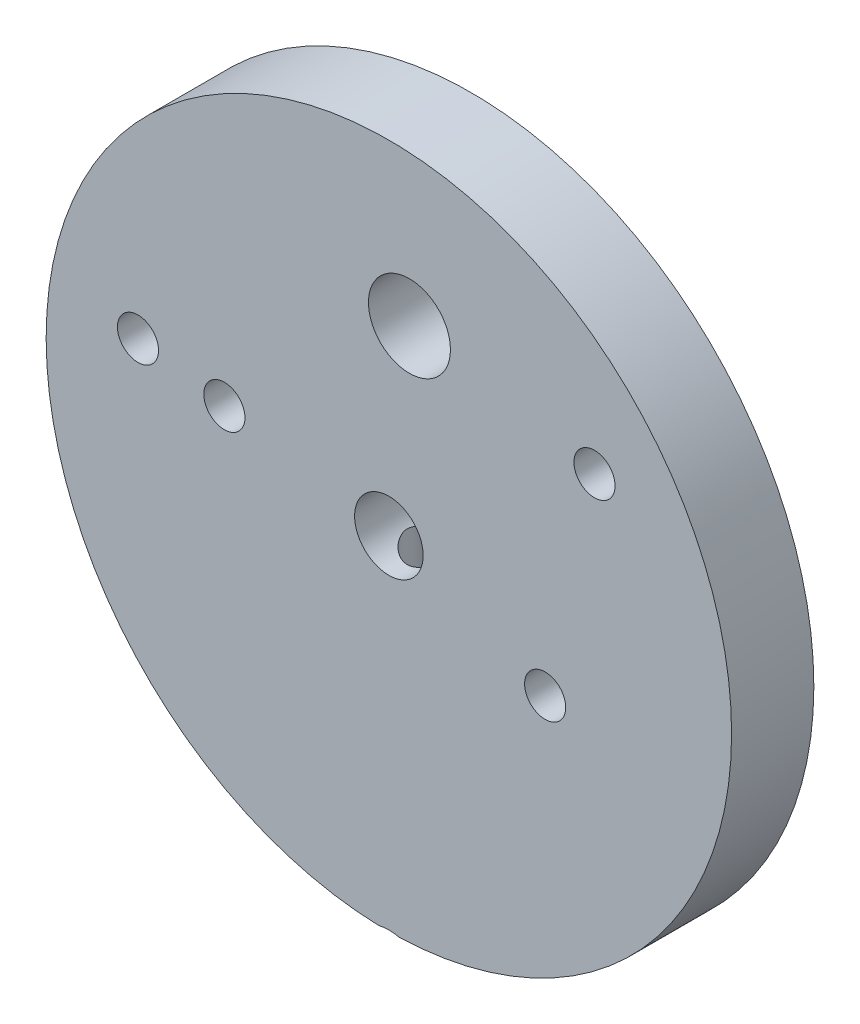
ISO-10303-21;
HEADER;
FILE_DESCRIPTION(('STEP AP214'),'2;1');
FILE_NAME('part.step','',(''),(''),'','','');
FILE_SCHEMA(('AUTOMOTIVE_DESIGN { 1 0 10303 214 1 1 1 1 }'));
ENDSEC;
DATA;
#1=APPLICATION_CONTEXT('core data for automotive mechanical design processes');
#2=APPLICATION_PROTOCOL_DEFINITION('international standard','automotive_design',2000,#1);
#3=PRODUCT_CONTEXT('',#1,'mechanical');
#4=PRODUCT('Part','Part','',(#3));
#5=PRODUCT_RELATED_PRODUCT_CATEGORY('part','',(#4));
#6=PRODUCT_DEFINITION_FORMATION('','',#4);
#7=PRODUCT_DEFINITION_CONTEXT('part definition',#1,'design');
#8=PRODUCT_DEFINITION('design','',#6,#7);
#9=PRODUCT_DEFINITION_SHAPE('','',#8);
#10=(LENGTH_UNIT() NAMED_UNIT(*) SI_UNIT(.MILLI.,.METRE.));
#11=(NAMED_UNIT(*) PLANE_ANGLE_UNIT() SI_UNIT($,.RADIAN.));
#12=(NAMED_UNIT(*) SI_UNIT($,.STERADIAN.) SOLID_ANGLE_UNIT());
#13=UNCERTAINTY_MEASURE_WITH_UNIT(LENGTH_MEASURE(1.E-05),#10,'distance_accuracy_value','');
#14=(GEOMETRIC_REPRESENTATION_CONTEXT(3) GLOBAL_UNCERTAINTY_ASSIGNED_CONTEXT((#13)) GLOBAL_UNIT_ASSIGNED_CONTEXT((#10,
#11,#12)) REPRESENTATION_CONTEXT('',''));
#15=CARTESIAN_POINT('',(0.,0.,0.));
#16=DIRECTION('',(0.,0.,1.));
#17=DIRECTION('',(1.,0.,0.));
#18=AXIS2_PLACEMENT_3D('',#15,#16,#17);
#19=CARTESIAN_POINT('',(0.,0.,3.));
#20=DIRECTION('',(0.,0.,1.));
#21=DIRECTION('',(1.,0.,0.));
#22=AXIS2_PLACEMENT_3D('',#19,#20,#21);
#23=PLANE('',#22);
#24=CARTESIAN_POINT('',(-2.83664534621359,-26.0287476091661,3.));
#25=CARTESIAN_POINT('',(-2.76531072517493,-25.979747647708,3.));
#26=CARTESIAN_POINT('',(-2.6935251877055,-25.9313937572425,3.));
#27=CARTESIAN_POINT('',(-2.54890587795035,-25.8362334592615,3.));
#28=CARTESIAN_POINT('',(-2.47607179603977,-25.7894275228763,3.));
#29=CARTESIAN_POINT('',(-2.32872818174244,-25.6973209891236,3.));
#30=CARTESIAN_POINT('',(-2.25421040362229,-25.6520335125885,3.));
#31=CARTESIAN_POINT('',(-2.10387584627041,-25.5636873397159,3.));
#32=CARTESIAN_POINT('',(-2.02805917154243,-25.5206284651849,3.));
#33=CARTESIAN_POINT('',(-1.79346473550118,-25.3926890623925,3.));
#34=CARTESIAN_POINT('',(-1.63229987426929,-25.312089953461,3.));
#35=CARTESIAN_POINT('',(-1.30302104487734,-25.1674390749372,3.));
#36=CARTESIAN_POINT('',(-1.13493074142441,-25.1033356270002,3.));
#37=CARTESIAN_POINT('',(-0.888434419115741,-25.0279764703033,3.));
#38=CARTESIAN_POINT('',(-0.8128906352692,-25.0073008818853,3.));
#39=CARTESIAN_POINT('',(-0.660576482159613,-24.9709760094303,3.));
#40=CARTESIAN_POINT('',(-0.583805949312308,-24.9553274017014,3.));
#41=CARTESIAN_POINT('',(-0.430179544278816,-24.929749902811,3.));
#42=CARTESIAN_POINT('',(-0.353333964597223,-24.9197597930517,3.));
#43=CARTESIAN_POINT('',(-0.199107895655327,-24.9056191999211,3.));
#44=CARTESIAN_POINT('',(-0.121727433519484,-24.9014684225826,3.));
#45=CARTESIAN_POINT('',(0.0484399656678558,-24.8989599826423,3.));
#46=CARTESIAN_POINT('',(0.141249236879402,-24.9019094067401,3.));
#47=CARTESIAN_POINT('',(0.326212401348018,-24.9162730746567,3.));
#48=CARTESIAN_POINT('',(0.418366158053664,-24.9276890328668,3.));
#49=CARTESIAN_POINT('',(0.602608166973431,-24.9585566782451,3.));
#50=CARTESIAN_POINT('',(0.694678002494478,-24.9781169747769,3.));
#51=CARTESIAN_POINT('',(0.876977203352027,-25.0243099762964,3.));
#52=CARTESIAN_POINT('',(0.967206813915699,-25.050941732227,3.));
#53=CARTESIAN_POINT('',(1.24673620285726,-25.1437740909094,3.));
#54=CARTESIAN_POINT('',(1.43252000344217,-25.2206319752431,3.));
#55=CARTESIAN_POINT('',(1.7047064715636,-25.3495840799246,3.));
#56=CARTESIAN_POINT('',(1.79451611571029,-25.3949436771718,3.));
#57=CARTESIAN_POINT('',(1.97215660266382,-25.4893928032348,3.));
#58=CARTESIAN_POINT('',(2.05998776589235,-25.5384817223611,3.));
#59=CARTESIAN_POINT('',(2.23039384174165,-25.6376531878738,3.));
#60=CARTESIAN_POINT('',(2.31303842428243,-25.6876173073952,3.));
#61=CARTESIAN_POINT('',(2.47689739966926,-25.7898487587656,3.));
#62=CARTESIAN_POINT('',(2.55811168003427,-25.8421162706346,3.));
#63=CARTESIAN_POINT('',(2.71865064586211,-25.9481415803404,3.));
#64=CARTESIAN_POINT('',(2.79798511486534,-26.0018846264753,3.));
#65=CARTESIAN_POINT('',(2.95553686167846,-26.1109377048038,3.));
#66=CARTESIAN_POINT('',(3.03375445763521,-26.166247276808,3.));
#67=CARTESIAN_POINT('',(3.11149968366827,-26.2222020176604,3.));
#68=B_SPLINE_CURVE_WITH_KNOTS('',3,(#24,#25,#26,#27,#28,#29,#30,#31,#32,#33,#34,#35,#36,#37,#38,
#39,#40,#41,#42,#43,#44,#45,#46,#47,#48,#49,#50,#51,#52,#53,#54,#55,#56,#57,#58,#59,#60,#61,#62,
#63,#64,#65,#66,#67),.UNSPECIFIED.,.F.,.F.,(4,2,2,2,2,2,2,2,2,2,2,2,2,2,2,2,2,2,2,2,2,4),(0.,
0.25963260985944,0.519343526732954,0.780907174044351,1.0424498749647,1.58244656220319,
2.12073034159699,2.35555508627146,2.59041141003198,2.82267578505833,3.05492846687895,
3.33308355702868,3.61129498627928,3.8933417824535,4.17535074437951,4.77670376445668,
5.07851488682883,5.38027677323758,5.66995963159193,5.95966517020511,6.24711760365554,
6.53448645222936),.UNSPECIFIED.);
#69=CARTESIAN_POINT('',(0.736747252931383,-24.9891417116574,3.));
#70=VERTEX_POINT('',#69);
#71=CARTESIAN_POINT('',(-0.736747252931388,-24.9891417116574,3.));
#72=VERTEX_POINT('',#71);
#73=EDGE_CURVE('E57',#70,#72,#68,.F.);
#74=ORIENTED_EDGE('',*,*,#73,.F.);
#75=CARTESIAN_POINT('',(0.,0.,3.));
#76=DIRECTION('',(0.,0.,1.));
#77=DIRECTION('',(1.,0.,0.));
#78=AXIS2_PLACEMENT_3D('',#75,#76,#77);
#79=CIRCLE('',#78,25.);
#80=EDGE_CURVE('E71',#70,#72,#79,.T.);
#81=ORIENTED_EDGE('',*,*,#80,.T.);
#82=EDGE_LOOP('',(#74,#81));
#83=FACE_BOUND('',#82,.T.);
#84=CARTESIAN_POINT('',(15.,11.4,3.));
#85=DIRECTION('',(0.,0.,1.));
#86=DIRECTION('',(1.,0.,0.));
#87=AXIS2_PLACEMENT_3D('',#84,#85,#86);
#88=CIRCLE('',#87,1.5);
#89=CARTESIAN_POINT('',(16.5,11.4,3.));
#90=VERTEX_POINT('',#89);
#91=EDGE_CURVE('E127',#90,#90,#88,.T.);
#92=ORIENTED_EDGE('',*,*,#91,.F.);
#93=EDGE_LOOP('',(#92));
#94=FACE_BOUND('',#93,.T.);
#95=CARTESIAN_POINT('',(1.5,14.,3.));
#96=DIRECTION('',(0.,0.,1.));
#97=DIRECTION('',(1.,0.,0.));
#98=AXIS2_PLACEMENT_3D('',#95,#96,#97);
#99=CIRCLE('',#98,2.99);
#100=CARTESIAN_POINT('',(4.49,14.,3.));
#101=VERTEX_POINT('',#100);
#102=EDGE_CURVE('E131',#101,#101,#99,.T.);
#103=ORIENTED_EDGE('',*,*,#102,.F.);
#104=EDGE_LOOP('',(#103));
#105=FACE_BOUND('',#104,.T.);
#106=CARTESIAN_POINT('',(-18.3,3.3,3.));
#107=DIRECTION('',(0.,0.,1.));
#108=DIRECTION('',(1.,0.,0.));
#109=AXIS2_PLACEMENT_3D('',#106,#107,#108);
#110=CIRCLE('',#109,1.5);
#111=CARTESIAN_POINT('',(-16.8,3.3,3.));
#112=VERTEX_POINT('',#111);
#113=EDGE_CURVE('E79',#112,#112,#110,.T.);
#114=ORIENTED_EDGE('',*,*,#113,.F.);
#115=EDGE_LOOP('',(#114));
#116=FACE_BOUND('',#115,.T.);
#117=CARTESIAN_POINT('',(-12.,2.2,3.));
#118=DIRECTION('',(0.,0.,1.));
#119=DIRECTION('',(1.,0.,0.));
#120=AXIS2_PLACEMENT_3D('',#117,#118,#119);
#121=CIRCLE('',#120,1.5);
#122=CARTESIAN_POINT('',(-10.5,2.2,3.));
#123=VERTEX_POINT('',#122);
#124=EDGE_CURVE('E137',#123,#123,#121,.T.);
#125=ORIENTED_EDGE('',*,*,#124,.F.);
#126=EDGE_LOOP('',(#125));
#127=FACE_BOUND('',#126,.T.);
#128=CARTESIAN_POINT('',(0.,0.,3.));
#129=DIRECTION('',(0.,0.,1.));
#130=DIRECTION('',(1.,0.,0.));
#131=AXIS2_PLACEMENT_3D('',#128,#129,#130);
#132=CIRCLE('',#131,2.5);
#133=CARTESIAN_POINT('',(2.5,0.,3.));
#134=VERTEX_POINT('',#133);
#135=EDGE_CURVE('E141',#134,#134,#132,.T.);
#136=ORIENTED_EDGE('',*,*,#135,.F.);
#137=EDGE_LOOP('',(#136));
#138=FACE_BOUND('',#137,.T.);
#139=CARTESIAN_POINT('',(11.4,-4.4,3.));
#140=DIRECTION('',(0.,0.,1.));
#141=DIRECTION('',(1.,0.,0.));
#142=AXIS2_PLACEMENT_3D('',#139,#140,#141);
#143=CIRCLE('',#142,1.5);
#144=CARTESIAN_POINT('',(12.9,-4.4,3.));
#145=VERTEX_POINT('',#144);
#146=EDGE_CURVE('E144',#145,#145,#143,.T.);
#147=ORIENTED_EDGE('',*,*,#146,.F.);
#148=EDGE_LOOP('',(#147));
#149=FACE_BOUND('',#148,.T.);
#150=ADVANCED_FACE('F36',(#83,#94,#105,#116,#127,#138,#149),#23,.T.);
#151=CARTESIAN_POINT('',(0.,0.,-3.));
#152=DIRECTION('',(0.,0.,1.));
#153=DIRECTION('',(1.,0.,0.));
#154=AXIS2_PLACEMENT_3D('',#151,#152,#153);
#155=PLANE('',#154);
#156=CARTESIAN_POINT('',(15.,11.4,-3.));
#157=DIRECTION('',(0.,0.,1.));
#158=DIRECTION('',(1.,0.,0.));
#159=AXIS2_PLACEMENT_3D('',#156,#157,#158);
#160=CIRCLE('',#159,1.5);
#161=CARTESIAN_POINT('',(16.5,11.4,-3.));
#162=VERTEX_POINT('',#161);
#163=EDGE_CURVE('E146',#162,#162,#160,.T.);
#164=ORIENTED_EDGE('',*,*,#163,.T.);
#165=EDGE_LOOP('',(#164));
#166=FACE_BOUND('',#165,.T.);
#167=CARTESIAN_POINT('',(1.5,14.,-3.));
#168=DIRECTION('',(0.,0.,1.));
#169=DIRECTION('',(1.,0.,0.));
#170=AXIS2_PLACEMENT_3D('',#167,#168,#169);
#171=CIRCLE('',#170,2.99);
#172=CARTESIAN_POINT('',(4.49,14.,-3.));
#173=VERTEX_POINT('',#172);
#174=EDGE_CURVE('E158',#173,#173,#171,.T.);
#175=ORIENTED_EDGE('',*,*,#174,.T.);
#176=EDGE_LOOP('',(#175));
#177=FACE_BOUND('',#176,.T.);
#178=CARTESIAN_POINT('',(-18.3,3.3,-3.));
#179=DIRECTION('',(0.,0.,1.));
#180=DIRECTION('',(1.,0.,0.));
#181=AXIS2_PLACEMENT_3D('',#178,#179,#180);
#182=CIRCLE('',#181,1.5);
#183=CARTESIAN_POINT('',(-16.8,3.3,-3.));
#184=VERTEX_POINT('',#183);
#185=EDGE_CURVE('E83',#184,#184,#182,.T.);
#186=ORIENTED_EDGE('',*,*,#185,.T.);
#187=EDGE_LOOP('',(#186));
#188=FACE_BOUND('',#187,.T.);
#189=CARTESIAN_POINT('',(0.,0.,-3.));
#190=DIRECTION('',(0.,0.,1.));
#191=DIRECTION('',(1.,0.,0.));
#192=AXIS2_PLACEMENT_3D('',#189,#190,#191);
#193=CIRCLE('',#192,25.);
#194=CARTESIAN_POINT('',(0.736747252931383,-24.9891417116574,-3.));
#195=VERTEX_POINT('',#194);
#196=CARTESIAN_POINT('',(-0.736747252931388,-24.9891417116574,-3.));
#197=VERTEX_POINT('',#196);
#198=EDGE_CURVE('E76',#195,#197,#193,.T.);
#199=ORIENTED_EDGE('',*,*,#198,.F.);
#200=CARTESIAN_POINT('',(-2.83664534621359,-26.0287476091661,-3.));
#201=CARTESIAN_POINT('',(-2.76531072517493,-25.979747647708,-3.));
#202=CARTESIAN_POINT('',(-2.6935251877055,-25.9313937572425,-3.));
#203=CARTESIAN_POINT('',(-2.54890587795035,-25.8362334592615,-3.));
#204=CARTESIAN_POINT('',(-2.47607179603977,-25.7894275228763,-3.));
#205=CARTESIAN_POINT('',(-2.32872818174244,-25.6973209891236,-3.));
#206=CARTESIAN_POINT('',(-2.25421040362229,-25.6520335125885,-3.));
#207=CARTESIAN_POINT('',(-2.10387584627041,-25.5636873397159,-3.));
#208=CARTESIAN_POINT('',(-2.02805917154243,-25.5206284651849,-3.));
#209=CARTESIAN_POINT('',(-1.79346473550118,-25.3926890623925,-3.));
#210=CARTESIAN_POINT('',(-1.63229987426929,-25.312089953461,-3.));
#211=CARTESIAN_POINT('',(-1.30302104487734,-25.1674390749372,-3.));
#212=CARTESIAN_POINT('',(-1.13493074142441,-25.1033356270002,-3.));
#213=CARTESIAN_POINT('',(-0.888434419115741,-25.0279764703033,-3.));
#214=CARTESIAN_POINT('',(-0.8128906352692,-25.0073008818853,-3.));
#215=CARTESIAN_POINT('',(-0.660576482159613,-24.9709760094303,-3.));
#216=CARTESIAN_POINT('',(-0.583805949312308,-24.9553274017014,-3.));
#217=CARTESIAN_POINT('',(-0.430179544278816,-24.929749902811,-3.));
#218=CARTESIAN_POINT('',(-0.353333964597223,-24.9197597930517,-3.));
#219=CARTESIAN_POINT('',(-0.199107895655327,-24.9056191999211,-3.));
#220=CARTESIAN_POINT('',(-0.121727433519484,-24.9014684225826,-3.));
#221=CARTESIAN_POINT('',(0.0484399656678558,-24.8989599826423,-3.));
#222=CARTESIAN_POINT('',(0.141249236879402,-24.9019094067401,-3.));
#223=CARTESIAN_POINT('',(0.326212401348018,-24.9162730746567,-3.));
#224=CARTESIAN_POINT('',(0.418366158053664,-24.9276890328668,-3.));
#225=CARTESIAN_POINT('',(0.602608166973431,-24.9585566782451,-3.));
#226=CARTESIAN_POINT('',(0.694678002494478,-24.9781169747769,-3.));
#227=CARTESIAN_POINT('',(0.876977203352027,-25.0243099762964,-3.));
#228=CARTESIAN_POINT('',(0.967206813915699,-25.050941732227,-3.));
#229=CARTESIAN_POINT('',(1.24673620285726,-25.1437740909094,-3.));
#230=CARTESIAN_POINT('',(1.43252000344217,-25.2206319752431,-3.));
#231=CARTESIAN_POINT('',(1.7047064715636,-25.3495840799246,-3.));
#232=CARTESIAN_POINT('',(1.79451611571029,-25.3949436771718,-3.));
#233=CARTESIAN_POINT('',(1.97215660266382,-25.4893928032348,-3.));
#234=CARTESIAN_POINT('',(2.05998776589235,-25.5384817223611,-3.));
#235=CARTESIAN_POINT('',(2.23039384174165,-25.6376531878738,-3.));
#236=CARTESIAN_POINT('',(2.31303842428243,-25.6876173073952,-3.));
#237=CARTESIAN_POINT('',(2.47689739966926,-25.7898487587656,-3.));
#238=CARTESIAN_POINT('',(2.55811168003427,-25.8421162706346,-3.));
#239=CARTESIAN_POINT('',(2.71865064586211,-25.9481415803404,-3.));
#240=CARTESIAN_POINT('',(2.79798511486534,-26.0018846264753,-3.));
#241=CARTESIAN_POINT('',(2.95553686167846,-26.1109377048038,-3.));
#242=CARTESIAN_POINT('',(3.03375445763521,-26.166247276808,-3.));
#243=CARTESIAN_POINT('',(3.11149968366827,-26.2222020176604,-3.));
#244=B_SPLINE_CURVE_WITH_KNOTS('',3,(#200,#201,#202,#203,#204,#205,#206,#207,#208,#209,#210,
#211,#212,#213,#214,#215,#216,#217,#218,#219,#220,#221,#222,#223,#224,#225,#226,#227,#228,#229,
#230,#231,#232,#233,#234,#235,#236,#237,#238,#239,#240,#241,#242,#243),.UNSPECIFIED.,.F.,.F.,(4,
2,2,2,2,2,2,2,2,2,2,2,2,2,2,2,2,2,2,2,2,4),(0.,0.25963260985944,0.519343526732954,
0.780907174044351,1.0424498749647,1.58244656220319,2.12073034159699,2.35555508627146,
2.59041141003198,2.82267578505833,3.05492846687895,3.33308355702868,3.61129498627928,
3.8933417824535,4.17535074437951,4.77670376445668,5.07851488682883,5.38027677323758,
5.66995963159193,5.95966517020511,6.24711760365554,6.53448645222936),.UNSPECIFIED.);
#245=EDGE_CURVE('E66',#195,#197,#244,.F.);
#246=ORIENTED_EDGE('',*,*,#245,.T.);
#247=EDGE_LOOP('',(#199,#246));
#248=FACE_BOUND('',#247,.T.);
#249=CARTESIAN_POINT('',(-12.,2.2,-3.));
#250=DIRECTION('',(0.,0.,1.));
#251=DIRECTION('',(1.,0.,0.));
#252=AXIS2_PLACEMENT_3D('',#249,#250,#251);
#253=CIRCLE('',#252,1.5);
#254=CARTESIAN_POINT('',(-10.5,2.2,-3.));
#255=VERTEX_POINT('',#254);
#256=EDGE_CURVE('E162',#255,#255,#253,.T.);
#257=ORIENTED_EDGE('',*,*,#256,.T.);
#258=EDGE_LOOP('',(#257));
#259=FACE_BOUND('',#258,.T.);
#260=CARTESIAN_POINT('',(0.,0.,-3.));
#261=DIRECTION('',(0.,0.,1.));
#262=DIRECTION('',(1.,0.,0.));
#263=AXIS2_PLACEMENT_3D('',#260,#261,#262);
#264=CIRCLE('',#263,2.5);
#265=CARTESIAN_POINT('',(2.5,0.,-3.));
#266=VERTEX_POINT('',#265);
#267=EDGE_CURVE('E154',#266,#266,#264,.T.);
#268=ORIENTED_EDGE('',*,*,#267,.T.);
#269=EDGE_LOOP('',(#268));
#270=FACE_BOUND('',#269,.T.);
#271=CARTESIAN_POINT('',(11.4,-4.4,-3.));
#272=DIRECTION('',(0.,0.,1.));
#273=DIRECTION('',(1.,0.,0.));
#274=AXIS2_PLACEMENT_3D('',#271,#272,#273);
#275=CIRCLE('',#274,1.5);
#276=CARTESIAN_POINT('',(12.9,-4.4,-3.));
#277=VERTEX_POINT('',#276);
#278=EDGE_CURVE('E147',#277,#277,#275,.T.);
#279=ORIENTED_EDGE('',*,*,#278,.T.);
#280=EDGE_LOOP('',(#279));
#281=FACE_BOUND('',#280,.T.);
#282=ADVANCED_FACE('F74',(#166,#177,#188,#248,#259,#270,#281),#155,.F.);
#283=CARTESIAN_POINT('',(0.,0.,3.));
#284=DIRECTION('',(0.,0.,-1.));
#285=DIRECTION('',(-1.,0.,0.));
#286=AXIS2_PLACEMENT_3D('',#283,#284,#285);
#287=CYLINDRICAL_SURFACE('',#286,25.);
#288=ORIENTED_EDGE('',*,*,#80,.F.);
#289=CARTESIAN_POINT('',(-2.16758617526592,-24.9058542015405,-2.08248147327669));
#290=CARTESIAN_POINT('',(-2.26419811052355,-24.8974462926179,-1.96978116987875));
#291=CARTESIAN_POINT('',(-2.35260218398907,-24.8891869614,-1.84999180535656));
#292=CARTESIAN_POINT('',(-2.51156332573361,-24.8736495124773,-1.59896640921571));
#293=CARTESIAN_POINT('',(-2.58210449157263,-24.8663722717505,-1.46772031703202));
#294=CARTESIAN_POINT('',(-2.71517230924507,-24.8522257870707,-1.17223414555063));
#295=CARTESIAN_POINT('',(-2.77399499209722,-24.8456635744722,-1.00629725947052));
#296=CARTESIAN_POINT('',(-2.86404719683586,-24.8354443067285,-0.666995962810196));
#297=CARTESIAN_POINT('',(-2.89526614218037,-24.8317883651931,-0.493628731899825));
#298=CARTESIAN_POINT('',(-2.93002341139618,-24.8277122664524,-0.138651220259233));
#299=CARTESIAN_POINT('',(-2.93267335411916,-24.8273959647119,0.0430479653611176));
#300=CARTESIAN_POINT('',(-2.90791833368191,-24.8303072519908,0.404362039114832));
#301=CARTESIAN_POINT('',(-2.8805120221463,-24.8335350000024,0.583976833373478));
#302=CARTESIAN_POINT('',(-2.7958518599429,-24.8432089858783,0.937540554156183));
#303=CARTESIAN_POINT('',(-2.73835224328342,-24.8496817061741,1.11143010401536));
#304=CARTESIAN_POINT('',(-2.59457976452862,-24.8651031794325,1.4467951485922));
#305=CARTESIAN_POINT('',(-2.50830701700608,-24.8740519225356,1.60827069273851));
#306=CARTESIAN_POINT('',(-2.31069844256378,-24.8931781658867,1.91096664400554));
#307=CARTESIAN_POINT('',(-2.19983127898705,-24.9033312224825,2.05249395272713));
#308=CARTESIAN_POINT('',(-1.95485284030474,-24.923755787641,2.31378337542357));
#309=CARTESIAN_POINT('',(-1.82074744697173,-24.9340272656177,2.43355098126902));
#310=CARTESIAN_POINT('',(-1.53944942100541,-24.9529361893474,2.64190624245401));
#311=CARTESIAN_POINT('',(-1.39312677911095,-24.9616266328222,2.73166213898459));
#312=CARTESIAN_POINT('',(-1.08670067369469,-24.9768400625505,2.88360537014624));
#313=CARTESIAN_POINT('',(-0.926603145070919,-24.9833639764217,2.94580450725641));
#314=CARTESIAN_POINT('',(-0.607396035639093,-24.9930998896091,3.03714233586883));
#315=CARTESIAN_POINT('',(-0.448788092323808,-24.9964849545025,3.06801884612167));
#316=CARTESIAN_POINT('',(-0.128596195267381,-25.0001812083907,3.10168932590994));
#317=CARTESIAN_POINT('',(0.0329869452802382,-25.000493225187,3.10449085813789));
#318=CARTESIAN_POINT('',(0.347976941281974,-24.9980557707246,3.08234298584731));
#319=CARTESIAN_POINT('',(0.501460370767483,-24.9954227722125,3.05844939054164));
#320=CARTESIAN_POINT('',(0.802252464567269,-24.9875776664031,2.98554161433037));
#321=CARTESIAN_POINT('',(0.949561123865766,-24.9823655570108,2.93652741301969));
#322=CARTESIAN_POINT('',(1.235177902944,-24.9698808079691,2.814737846973));
#323=CARTESIAN_POINT('',(1.37341082598936,-24.9625931125497,2.74178825045375));
#324=CARTESIAN_POINT('',(1.63633532116577,-24.9467389622145,2.57473002126735));
#325=CARTESIAN_POINT('',(1.76102437011938,-24.9381722697293,2.48061745600362));
#326=CARTESIAN_POINT('',(1.99950607302834,-24.9202115945503,2.26938001838269));
#327=CARTESIAN_POINT('',(2.11253756988607,-24.9107976907587,2.1513982424247));
#328=CARTESIAN_POINT('',(2.31846111934454,-24.8924778103421,1.8989804270771));
#329=CARTESIAN_POINT('',(2.41134797613937,-24.8835719651935,1.7645401565861));
#330=CARTESIAN_POINT('',(2.57984127227692,-24.8666848647037,1.47485322999587));
#331=CARTESIAN_POINT('',(2.65417276206845,-24.8587844235291,1.31885975889111));
#332=CARTESIAN_POINT('',(2.77688937706012,-24.8453760065678,0.996885138901806));
#333=CARTESIAN_POINT('',(2.82526886317361,-24.8398685508,0.830901828041465));
#334=CARTESIAN_POINT('',(2.8966095271968,-24.8316535899424,0.486265643165659));
#335=CARTESIAN_POINT('',(2.9184304015994,-24.8290720028536,0.307372927706819));
#336=CARTESIAN_POINT('',(2.93247105177914,-24.8274175247801,-0.0515961252130576));
#337=CARTESIAN_POINT('',(2.92468699609087,-24.8283450879491,-0.231672612866914));
#338=CARTESIAN_POINT('',(2.87929354920295,-24.8336505421533,-0.591012729747056));
#339=CARTESIAN_POINT('',(2.84119476015418,-24.8380850415636,-0.770214058213243));
#340=CARTESIAN_POINT('',(2.73535155764383,-24.8499631308845,-1.11955906219915));
#341=CARTESIAN_POINT('',(2.66760622732317,-24.8574068138575,-1.28970245740758));
#342=CARTESIAN_POINT('',(2.50466778336005,-24.8743494650221,-1.61431487761464));
#343=CARTESIAN_POINT('',(2.40972423404199,-24.8838295582078,-1.76890988902777));
#344=CARTESIAN_POINT('',(2.19431530567908,-24.903747405814,-2.0591311009763));
#345=CARTESIAN_POINT('',(2.0738540432621,-24.9141850056116,-2.19476035529772));
#346=CARTESIAN_POINT('',(1.81529310574532,-24.9343311264593,-2.43763912178974));
#347=CARTESIAN_POINT('',(1.6780015111583,-24.9440523484622,-2.54574645030949));
#348=CARTESIAN_POINT('',(1.38622796118539,-24.9619643010225,-2.73572465981523));
#349=CARTESIAN_POINT('',(1.23175294320882,-24.9701556456799,-2.81760607748252));
#350=CARTESIAN_POINT('',(0.919601670453763,-24.983540522943,-2.94778632494971));
#351=CARTESIAN_POINT('',(0.762627358327021,-24.9888800443824,-2.99775363130508));
#352=CARTESIAN_POINT('',(0.442271726680717,-24.9966000297288,-3.06923754714054));
#353=CARTESIAN_POINT('',(0.278892813926782,-24.9989815944074,-3.09076474049114));
#354=CARTESIAN_POINT('',(-0.0410283352265158,-25.0004532260287,-3.10411022796195));
#355=CARTESIAN_POINT('',(-0.197512920330296,-24.999698983349,-3.097333700603));
#356=CARTESIAN_POINT('',(-0.507066084721128,-24.9953364544472,-3.05750443704279));
#357=CARTESIAN_POINT('',(-0.660134509100236,-24.9917280390702,-3.02445051175532));
#358=CARTESIAN_POINT('',(-0.95733703275022,-24.9821029795024,-2.93373516711902));
#359=CARTESIAN_POINT('',(-1.10153255769605,-24.9761057361452,-2.87627174526619));
#360=CARTESIAN_POINT('',(-1.37859271091778,-24.9623461688007,-2.73884806260258));
#361=CARTESIAN_POINT('',(-1.51146246663922,-24.9545846494416,-2.65889805325247));
#362=CARTESIAN_POINT('',(-1.73500302855206,-24.939916220667,-2.49906224691524));
#363=CARTESIAN_POINT('',(-1.82850796602357,-24.9331998879828,-2.42307209714361));
#364=CARTESIAN_POINT('',(-2.00566458170176,-24.9195745672006,-2.26043081002573));
#365=CARTESIAN_POINT('',(-2.08931877499408,-24.9126656288382,-2.17378240554021));
#366=CARTESIAN_POINT('',(-2.16758617526592,-24.9058542015405,-2.08248147327669));
#367=B_SPLINE_CURVE_WITH_KNOTS('',3,(#289,#290,#291,#292,#293,#294,#295,#296,#297,#298,#299,
#300,#301,#302,#303,#304,#305,#306,#307,#308,#309,#310,#311,#312,#313,#314,#315,#316,#317,#318,
#319,#320,#321,#322,#323,#324,#325,#326,#327,#328,#329,#330,#331,#332,#333,#334,#335,#336,#337,
#338,#339,#340,#341,#342,#343,#344,#345,#346,#347,#348,#349,#350,#351,#352,#353,#354,#355,#356,
#357,#358,#359,#360,#361,#362,#363,#364,#365,#366),.UNSPECIFIED.,.T.,.F.,(4,2,2,2,2,2,2,2,2,2,2,
2,2,2,2,2,2,2,2,2,2,2,2,2,2,2,2,2,2,2,2,2,2,2,2,2,2,2,4),(0.,0.445715829158682,
0.891827072447249,1.41791500766711,1.94420442947785,2.48681380746776,3.02944752884583,
3.5765836228078,4.12371753813439,4.66120575069208,5.19855811908104,5.71152708301774,
6.2242761309593,6.70669784993856,7.18898961315385,7.65286113182454,8.11673302729186,
8.58405938924099,9.05147266371235,9.54030497235087,10.0292632134995,10.545884339747,
11.062617676692,11.6008326986407,12.1391173786636,12.6862728153536,13.2334451747558,
13.7757493625761,14.317966130075,14.8403142092439,15.3624521626598,15.8543898487369,
16.3461444106194,16.8137828777068,17.2814425072438,17.7453790545593,18.2091044386824,
18.5702808049504,18.9313647550362),.UNSPECIFIED.);
#368=EDGE_CURVE('E11',#70,#195,#367,.T.);
#369=ORIENTED_EDGE('',*,*,#368,.T.);
#370=ORIENTED_EDGE('',*,*,#198,.T.);
#371=EDGE_CURVE('E50',#197,#72,#367,.T.);
#372=ORIENTED_EDGE('',*,*,#371,.T.);
#373=EDGE_LOOP('',(#288,#369,#370,#372));
#374=FACE_BOUND('',#373,.T.);
#375=ADVANCED_FACE('F38',(#374),#287,.T.);
#376=CARTESIAN_POINT('',(-18.3,3.3,3.));
#377=DIRECTION('',(0.,0.,-1.));
#378=DIRECTION('',(-1.,0.,0.));
#379=AXIS2_PLACEMENT_3D('',#376,#377,#378);
#380=CYLINDRICAL_SURFACE('',#379,1.5);
#381=ORIENTED_EDGE('',*,*,#113,.T.);
#382=EDGE_LOOP('',(#381));
#383=FACE_BOUND('',#382,.T.);
#384=ORIENTED_EDGE('',*,*,#185,.F.);
#385=EDGE_LOOP('',(#384));
#386=FACE_BOUND('',#385,.T.);
#387=ADVANCED_FACE('F116',(#383,#386),#380,.F.);
#388=CARTESIAN_POINT('',(-12.,2.2,3.));
#389=DIRECTION('',(0.,0.,-1.));
#390=DIRECTION('',(-1.,0.,0.));
#391=AXIS2_PLACEMENT_3D('',#388,#389,#390);
#392=CYLINDRICAL_SURFACE('',#391,1.5);
#393=ORIENTED_EDGE('',*,*,#124,.T.);
#394=EDGE_LOOP('',(#393));
#395=FACE_BOUND('',#394,.T.);
#396=ORIENTED_EDGE('',*,*,#256,.F.);
#397=EDGE_LOOP('',(#396));
#398=FACE_BOUND('',#397,.T.);
#399=ADVANCED_FACE('F170',(#395,#398),#392,.F.);
#400=CARTESIAN_POINT('',(1.5,14.,3.));
#401=DIRECTION('',(0.,0.,-1.));
#402=DIRECTION('',(-1.,0.,0.));
#403=AXIS2_PLACEMENT_3D('',#400,#401,#402);
#404=CYLINDRICAL_SURFACE('',#403,2.99);
#405=ORIENTED_EDGE('',*,*,#102,.T.);
#406=EDGE_LOOP('',(#405));
#407=FACE_BOUND('',#406,.T.);
#408=ORIENTED_EDGE('',*,*,#174,.F.);
#409=EDGE_LOOP('',(#408));
#410=FACE_BOUND('',#409,.T.);
#411=ADVANCED_FACE('F176',(#407,#410),#404,.F.);
#412=CARTESIAN_POINT('',(0.,0.,3.));
#413=DIRECTION('',(0.,0.,-1.));
#414=DIRECTION('',(-1.,0.,0.));
#415=AXIS2_PLACEMENT_3D('',#412,#413,#414);
#416=CYLINDRICAL_SURFACE('',#415,2.5);
#417=CARTESIAN_POINT('',(0.,-2.5,-1.65));
#418=CARTESIAN_POINT('',(-0.0830573983732392,-2.49999873549003,-1.64999873137196));
#419=CARTESIAN_POINT('',(-0.166127065031046,-2.49582409665183,-1.64369332813587));
#420=CARTESIAN_POINT('',(-0.329627564785519,-2.47953793670965,-1.61885588365078));
#421=CARTESIAN_POINT('',(-0.410056740989749,-2.46742152850525,-1.60031631385543));
#422=CARTESIAN_POINT('',(-0.565666795275703,-2.43645078323809,-1.55213728113011));
#423=CARTESIAN_POINT('',(-0.640870379585382,-2.41762810153113,-1.52254993559189));
#424=CARTESIAN_POINT('',(-0.784950958130406,-2.37476519567406,-1.45352693083464));
#425=CARTESIAN_POINT('',(-0.853827124859529,-2.3507242904579,-1.4140899859757));
#426=CARTESIAN_POINT('',(-0.989836866046781,-2.29695661149613,-1.32286952215449));
#427=CARTESIAN_POINT('',(-1.05633669830188,-2.26692168776846,-1.27032656825891));
#428=CARTESIAN_POINT('',(-1.18018285126921,-2.20498845637974,-1.15618952097825));
#429=CARTESIAN_POINT('',(-1.23751597614873,-2.17308755114355,-1.09458262017789));
#430=CARTESIAN_POINT('',(-1.350431491955,-2.10506784648215,-0.953025393794767));
#431=CARTESIAN_POINT('',(-1.40438210241811,-2.06905676275693,-0.871711330887167));
#432=CARTESIAN_POINT('',(-1.49776993203111,-2.00249251833605,-0.69912083324243));
#433=CARTESIAN_POINT('',(-1.53723225426474,-1.97192996499629,-0.607861988604589));
#434=CARTESIAN_POINT('',(-1.59072490572626,-1.92884004929685,-0.444135605276352));
#435=CARTESIAN_POINT('',(-1.608795235838,-1.91365570400325,-0.373693969164825));
#436=CARTESIAN_POINT('',(-1.63553399265365,-1.89085843424037,-0.2299018511051));
#437=CARTESIAN_POINT('',(-1.64421813584104,-1.88323285495121,-0.156556445501191));
#438=CARTESIAN_POINT('',(-1.65164261236611,-1.87672751277291,-0.00867667417277746));
#439=CARTESIAN_POINT('',(-1.6503449865543,-1.87788113567674,0.065861153473412));
#440=CARTESIAN_POINT('',(-1.63781110929921,-1.8888189423104,0.213476461715619));
#441=CARTESIAN_POINT('',(-1.62656646304847,-1.89861041595223,0.286552655480399));
#442=CARTESIAN_POINT('',(-1.5955062485521,-1.92477146257471,0.426367588716838));
#443=CARTESIAN_POINT('',(-1.57605424200619,-1.94086012047488,0.49324304013499));
#444=CARTESIAN_POINT('',(-1.52947910263703,-1.97777008130563,0.622849541099383));
#445=CARTESIAN_POINT('',(-1.50235345168169,-1.9985929373381,0.685579221847336));
#446=CARTESIAN_POINT('',(-1.4349555942054,-2.04767344699339,0.818549093219997));
#447=CARTESIAN_POINT('',(-1.39313654723765,-2.07658411071837,0.887762289651974));
#448=CARTESIAN_POINT('',(-1.30024206663366,-2.13598181471749,1.0189919318167));
#449=CARTESIAN_POINT('',(-1.24915529331516,-2.16647075308914,1.08099940667233));
#450=CARTESIAN_POINT('',(-1.12681675112711,-2.23295257125343,1.20920418248633));
#451=CARTESIAN_POINT('',(-1.05357972912127,-2.26877919105011,1.27361436846183));
#452=CARTESIAN_POINT('',(-0.8954851438868,-2.33569104521111,1.38930624083507));
#453=CARTESIAN_POINT('',(-0.810639038986188,-2.36678089167,1.44060073114898));
#454=CARTESIAN_POINT('',(-0.648739426272081,-2.41553581634305,1.51923062986409));
#455=CARTESIAN_POINT('',(-0.573446407588017,-2.43463913774794,1.54929570380841));
#456=CARTESIAN_POINT('',(-0.417976051373882,-2.4660834146067,1.59825596853883));
#457=CARTESIAN_POINT('',(-0.33780286329529,-2.47843002823382,1.61716050638165));
#458=CARTESIAN_POINT('',(-0.174366759571419,-2.49526903279627,1.64285212544903));
#459=CARTESIAN_POINT('',(-0.0910926735099016,-2.49972950264785,1.64958996132531));
#460=CARTESIAN_POINT('',(0.0755454771473694,-2.50024632578377,1.65037341496494));
#461=CARTESIAN_POINT('',(0.158909538677221,-2.49630295692062,1.64441945235176));
#462=CARTESIAN_POINT('',(0.317590995066729,-2.48094276300905,1.62100177024052));
#463=CARTESIAN_POINT('',(0.393076905917277,-2.4700348147583,1.60432124818647));
#464=CARTESIAN_POINT('',(0.539940099102308,-2.44214181786327,1.56103485655246));
#465=CARTESIAN_POINT('',(0.611316719406964,-2.42515579316953,1.53442739282274));
#466=CARTESIAN_POINT('',(0.753061900566429,-2.38509288962557,1.47031801304004));
#467=CARTESIAN_POINT('',(0.823069989043658,-2.36169438729977,1.43222519006879));
#468=CARTESIAN_POINT('',(0.955962444034783,-2.31110387644411,1.34717107768241));
#469=CARTESIAN_POINT('',(1.01884206641326,-2.28390936814435,1.30020393702918));
#470=CARTESIAN_POINT('',(1.14612838724312,-2.22308599354602,1.19038919580252));
#471=CARTESIAN_POINT('',(1.20922126106421,-2.18911767364703,1.12620583079495));
#472=CARTESIAN_POINT('',(1.32429793175259,-2.12148327059167,0.988334427798432));
#473=CARTESIAN_POINT('',(1.37627528682548,-2.08781737346631,0.914640917829759));
#474=CARTESIAN_POINT('',(1.46353640050704,-2.0274590554466,0.766296600582146));
#475=CARTESIAN_POINT('',(1.49996651133877,-2.00040607756764,0.692470451905224));
#476=CARTESIAN_POINT('',(1.56184713022858,-1.95247859125419,0.538503680951202));
#477=CARTESIAN_POINT('',(1.58731746510718,-1.93159294745003,0.458374774082886));
#478=CARTESIAN_POINT('',(1.6226819945088,-1.90193273164488,0.307201438130989));
#479=CARTESIAN_POINT('',(1.63447382745328,-1.89171317806773,0.236891667561832));
#480=CARTESIAN_POINT('',(1.64882828119084,-1.87921870273532,0.0946611706312379));
#481=CARTESIAN_POINT('',(1.65139975183536,-1.8769361629707,0.0227420557128786));
#482=CARTESIAN_POINT('',(1.64714925615308,-1.88066605675987,-0.120591133637519));
#483=CARTESIAN_POINT('',(1.64032696287034,-1.88667877903555,-0.192005190403728));
#484=CARTESIAN_POINT('',(1.61773943894529,-1.90607790977934,-0.332402434524805));
#485=CARTESIAN_POINT('',(1.60196240572203,-1.91947404910829,-0.401382285826582));
#486=CARTESIAN_POINT('',(1.55672361400764,-1.95644518519264,-0.554170797651737));
#487=CARTESIAN_POINT('',(1.52467713481425,-1.98181441881501,-0.636772363273417));
#488=CARTESIAN_POINT('',(1.44883296418163,-2.03791662644481,-0.794394209676626));
#489=CARTESIAN_POINT('',(1.40501894611546,-2.06865703170771,-0.86940375646762));
#490=CARTESIAN_POINT('',(1.30588975445997,-2.13264932094016,-1.01234437962015));
#491=CARTESIAN_POINT('',(1.25038987560408,-2.1659352858846,-1.08013166298805));
#492=CARTESIAN_POINT('',(1.1291028716024,-2.23156562575566,-1.20635347060613));
#493=CARTESIAN_POINT('',(1.06331279816866,-2.26390972766489,-1.2647853046465));
#494=CARTESIAN_POINT('',(0.913224109526746,-2.328844852877,-1.37783171013876));
#495=CARTESIAN_POINT('',(0.827637911480485,-2.36095353516902,-1.43103774089958));
#496=CARTESIAN_POINT('',(0.646049497163131,-2.41693780003556,-1.52162979943429));
#497=CARTESIAN_POINT('',(0.550067122404143,-2.44082871479072,-1.55904531806631));
#498=CARTESIAN_POINT('',(0.3780291357627,-2.47235569176035,-1.60788092445762));
#499=CARTESIAN_POINT('',(0.303664744230145,-2.48264654834952,-1.62360538601067));
#500=CARTESIAN_POINT('',(0.152869610757762,-2.49646746879981,-1.64466271697479));
#501=CARTESIAN_POINT('',(0.0764400010130794,-2.50000116376319,-1.65000116755317));
#502=CARTESIAN_POINT('',(0.,-2.5,-1.65));
#503=B_SPLINE_CURVE_WITH_KNOTS('',3,(#417,#418,#419,#420,#421,#422,#423,#424,#425,#426,#427,
#428,#429,#430,#431,#432,#433,#434,#435,#436,#437,#438,#439,#440,#441,#442,#443,#444,#445,#446,
#447,#448,#449,#450,#451,#452,#453,#454,#455,#456,#457,#458,#459,#460,#461,#462,#463,#464,#465,
#466,#467,#468,#469,#470,#471,#472,#473,#474,#475,#476,#477,#478,#479,#480,#481,#482,#483,#484,
#485,#486,#487,#488,#489,#490,#491,#492,#493,#494,#495,#496,#497,#498,#499,#500,#501,#502),
.UNSPECIFIED.,.T.,.F.,(4,2,2,2,2,2,2,2,2,2,2,2,2,2,2,2,2,2,2,2,2,2,2,2,2,2,2,2,2,2,2,2,2,2,2,2,
2,2,2,2,2,2,4),(0.,0.248863173219164,0.497879632505738,0.745735911637783,0.993624559661681,
1.26236142699035,1.53148173454875,1.84208059721148,2.15213873331274,2.37412103166173,
2.59573105830194,2.81818424963007,3.0408253600701,3.25449658913793,3.46823801663209,
3.72496879793679,3.98201585159,4.29224112966059,4.60216239062961,4.8509948640788,
5.09961864119514,5.34924649914315,5.59886610388089,5.83205917661708,6.06528971354039,
6.31352952087294,6.5619335787085,6.84938688817397,7.13700633715916,7.39601090345959,
7.65454492637288,7.86965548867984,8.08455952907284,8.29947104952726,8.51466648895039,
8.78967221613734,9.06506148314461,9.34518323893304,9.62538540113005,9.94089155188798,
10.2558058174588,10.484964597082,10.7140001987933),.UNSPECIFIED.);
#504=CARTESIAN_POINT('',(0.,-2.5,-1.65));
#505=VERTEX_POINT('',#504);
#506=EDGE_CURVE('E41',#505,#505,#503,.T.);
#507=ORIENTED_EDGE('',*,*,#506,.F.);
#508=EDGE_LOOP('',(#507));
#509=FACE_BOUND('',#508,.T.);
#510=ORIENTED_EDGE('',*,*,#135,.T.);
#511=EDGE_LOOP('',(#510));
#512=FACE_BOUND('',#511,.T.);
#513=ORIENTED_EDGE('',*,*,#267,.F.);
#514=EDGE_LOOP('',(#513));
#515=FACE_BOUND('',#514,.T.);
#516=ADVANCED_FACE('F208',(#509,#512,#515),#416,.F.);
#517=CARTESIAN_POINT('',(15.,11.4,3.));
#518=DIRECTION('',(0.,0.,-1.));
#519=DIRECTION('',(-1.,0.,0.));
#520=AXIS2_PLACEMENT_3D('',#517,#518,#519);
#521=CYLINDRICAL_SURFACE('',#520,1.5);
#522=ORIENTED_EDGE('',*,*,#91,.T.);
#523=EDGE_LOOP('',(#522));
#524=FACE_BOUND('',#523,.T.);
#525=ORIENTED_EDGE('',*,*,#163,.F.);
#526=EDGE_LOOP('',(#525));
#527=FACE_BOUND('',#526,.T.);
#528=ADVANCED_FACE('F198',(#524,#527),#521,.F.);
#529=CARTESIAN_POINT('',(11.4,-4.4,3.));
#530=DIRECTION('',(0.,0.,-1.));
#531=DIRECTION('',(-1.,0.,0.));
#532=AXIS2_PLACEMENT_3D('',#529,#530,#531);
#533=CYLINDRICAL_SURFACE('',#532,1.5);
#534=ORIENTED_EDGE('',*,*,#146,.T.);
#535=EDGE_LOOP('',(#534));
#536=FACE_BOUND('',#535,.T.);
#537=ORIENTED_EDGE('',*,*,#278,.F.);
#538=EDGE_LOOP('',(#537));
#539=FACE_BOUND('',#538,.T.);
#540=ADVANCED_FACE('F93',(#536,#539),#533,.F.);
#541=CARTESIAN_POINT('',(0.,-24.,0.));
#542=DIRECTION('',(0.,-1.,0.));
#543=DIRECTION('',(1.,0.,0.));
#544=AXIS2_PLACEMENT_3D('',#541,#542,#543);
#545=CONICAL_SURFACE('',#544,2.1,0.785398163397453);
#546=CARTESIAN_POINT('',(0.,-24.,0.));
#547=DIRECTION('',(0.,1.,0.));
#548=DIRECTION('',(-1.,0.,0.));
#549=AXIS2_PLACEMENT_3D('',#546,#547,#548);
#550=CIRCLE('',#549,2.1);
#551=CARTESIAN_POINT('',(-2.1,-24.,0.));
#552=VERTEX_POINT('',#551);
#553=EDGE_CURVE('E271',#552,#552,#550,.T.);
#554=ORIENTED_EDGE('',*,*,#553,.T.);
#555=EDGE_LOOP('',(#554));
#556=FACE_BOUND('',#555,.T.);
#557=ORIENTED_EDGE('',*,*,#73,.T.);
#558=ORIENTED_EDGE('',*,*,#371,.F.);
#559=ORIENTED_EDGE('',*,*,#245,.F.);
#560=ORIENTED_EDGE('',*,*,#368,.F.);
#561=EDGE_LOOP('',(#557,#558,#559,#560));
#562=FACE_BOUND('',#561,.T.);
#563=ADVANCED_FACE('F65',(#556,#562),#545,.F.);
#564=CARTESIAN_POINT('',(-2.1,-7.5,0.));
#565=DIRECTION('',(0.,1.,0.));
#566=DIRECTION('',(-1.,0.,0.));
#567=AXIS2_PLACEMENT_3D('',#564,#565,#566);
#568=PLANE('',#567);
#569=CARTESIAN_POINT('',(0.,-7.5,0.));
#570=DIRECTION('',(0.,-1.,0.));
#571=DIRECTION('',(0.,0.,-1.));
#572=AXIS2_PLACEMENT_3D('',#569,#570,#571);
#573=CIRCLE('',#572,1.65);
#574=CARTESIAN_POINT('',(0.,-7.5,-1.65));
#575=VERTEX_POINT('',#574);
#576=EDGE_CURVE('E276',#575,#575,#573,.T.);
#577=ORIENTED_EDGE('',*,*,#576,.F.);
#578=EDGE_LOOP('',(#577));
#579=FACE_BOUND('',#578,.T.);
#580=CARTESIAN_POINT('',(0.,-7.5,0.));
#581=DIRECTION('',(0.,1.,0.));
#582=DIRECTION('',(-1.,0.,0.));
#583=AXIS2_PLACEMENT_3D('',#580,#581,#582);
#584=CIRCLE('',#583,2.1);
#585=CARTESIAN_POINT('',(-2.1,-7.5,0.));
#586=VERTEX_POINT('',#585);
#587=EDGE_CURVE('E77',#586,#586,#584,.T.);
#588=ORIENTED_EDGE('',*,*,#587,.F.);
#589=EDGE_LOOP('',(#588));
#590=FACE_BOUND('',#589,.T.);
#591=ADVANCED_FACE('F92',(#579,#590),#568,.F.);
#592=CARTESIAN_POINT('',(0.,-7.5,0.));
#593=DIRECTION('',(0.,1.,0.));
#594=DIRECTION('',(-1.,0.,0.));
#595=AXIS2_PLACEMENT_3D('',#592,#593,#594);
#596=CYLINDRICAL_SURFACE('',#595,2.1);
#597=ORIENTED_EDGE('',*,*,#553,.F.);
#598=EDGE_LOOP('',(#597));
#599=FACE_BOUND('',#598,.T.);
#600=ORIENTED_EDGE('',*,*,#587,.T.);
#601=EDGE_LOOP('',(#600));
#602=FACE_BOUND('',#601,.T.);
#603=ADVANCED_FACE('F97',(#599,#602),#596,.F.);
#604=CARTESIAN_POINT('',(0.,-7.5,0.));
#605=DIRECTION('',(0.,-1.,0.));
#606=DIRECTION('',(0.,0.,-1.));
#607=AXIS2_PLACEMENT_3D('',#604,#605,#606);
#608=CYLINDRICAL_SURFACE('',#607,1.65);
#609=ORIENTED_EDGE('',*,*,#506,.T.);
#610=EDGE_LOOP('',(#609));
#611=FACE_BOUND('',#610,.T.);
#612=ORIENTED_EDGE('',*,*,#576,.T.);
#613=EDGE_LOOP('',(#612));
#614=FACE_BOUND('',#613,.T.);
#615=ADVANCED_FACE('F95',(#611,#614),#608,.F.);
#616=CLOSED_SHELL('',(#150,#282,#375,#387,#399,#411,#516,#528,#540,#563,#591,#603,#615));
#617=MANIFOLD_SOLID_BREP('B2',#616);
#618=ADVANCED_BREP_SHAPE_REPRESENTATION('',(#18,#617),#14);
#619=SHAPE_DEFINITION_REPRESENTATION(#9,#618);
ENDSEC;
END-ISO-10303-21;
